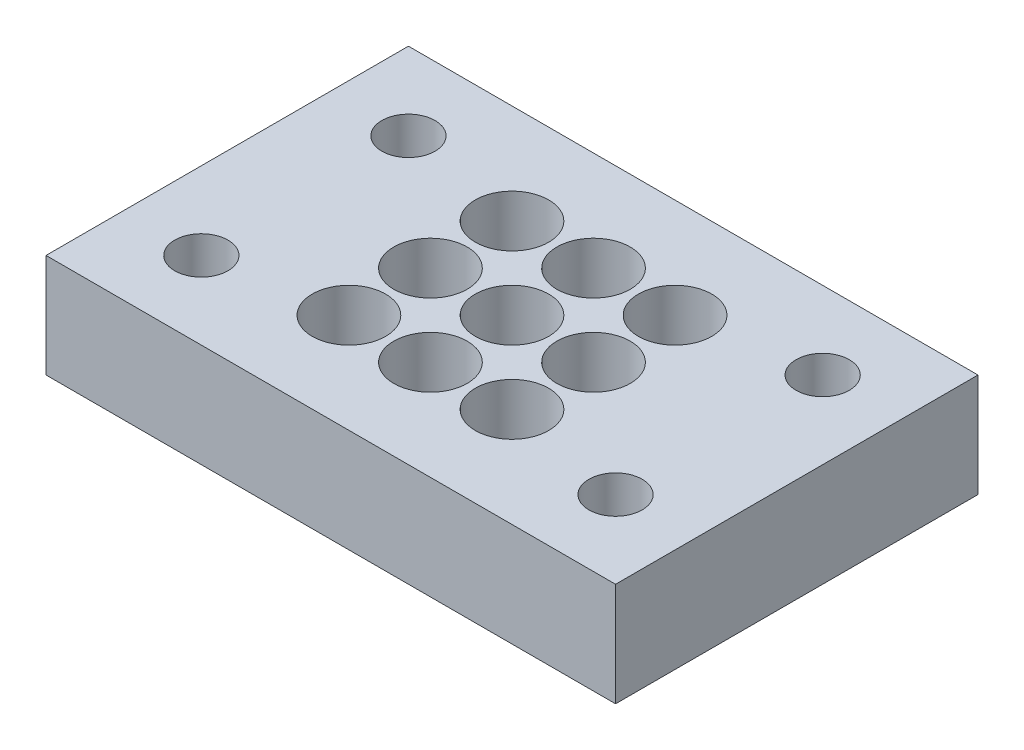
ISO-10303-21;
HEADER;
FILE_DESCRIPTION(('STEP AP214'),'2;1');
FILE_NAME('part.step','',(''),(''),'','','');
FILE_SCHEMA(('AUTOMOTIVE_DESIGN { 1 0 10303 214 1 1 1 1 }'));
ENDSEC;
DATA;
#1=APPLICATION_CONTEXT('core data for automotive mechanical design processes');
#2=APPLICATION_PROTOCOL_DEFINITION('international standard','automotive_design',2000,#1);
#3=PRODUCT_CONTEXT('',#1,'mechanical');
#4=PRODUCT('Part','Part','',(#3));
#5=PRODUCT_RELATED_PRODUCT_CATEGORY('part','',(#4));
#6=PRODUCT_DEFINITION_FORMATION('','',#4);
#7=PRODUCT_DEFINITION_CONTEXT('part definition',#1,'design');
#8=PRODUCT_DEFINITION('design','',#6,#7);
#9=PRODUCT_DEFINITION_SHAPE('','',#8);
#10=(LENGTH_UNIT() NAMED_UNIT(*) SI_UNIT(.MILLI.,.METRE.));
#11=(NAMED_UNIT(*) PLANE_ANGLE_UNIT() SI_UNIT($,.RADIAN.));
#12=(NAMED_UNIT(*) SI_UNIT($,.STERADIAN.) SOLID_ANGLE_UNIT());
#13=UNCERTAINTY_MEASURE_WITH_UNIT(LENGTH_MEASURE(1.E-05),#10,'distance_accuracy_value','');
#14=(GEOMETRIC_REPRESENTATION_CONTEXT(3) GLOBAL_UNCERTAINTY_ASSIGNED_CONTEXT((#13)) GLOBAL_UNIT_ASSIGNED_CONTEXT((#10,
#11,#12)) REPRESENTATION_CONTEXT('',''));
#15=CARTESIAN_POINT('',(0.,0.,0.));
#16=DIRECTION('',(0.,0.,1.));
#17=DIRECTION('',(1.,0.,0.));
#18=AXIS2_PLACEMENT_3D('',#15,#16,#17);
#19=CARTESIAN_POINT('',(0.,12.7,0.));
#20=DIRECTION('',(0.,0.,-1.));
#21=DIRECTION('',(-1.,0.,0.));
#22=AXIS2_PLACEMENT_3D('',#19,#20,#21);
#23=PLANE('',#22);
#24=DIRECTION('',(1.,0.,0.));
#25=VECTOR('',#24,1.);
#26=CARTESIAN_POINT('',(0.,0.,0.));
#27=LINE('',#26,#25);
#28=CARTESIAN_POINT('',(0.,0.,0.));
#29=VERTEX_POINT('',#28);
#30=CARTESIAN_POINT('',(69.85,0.,0.));
#31=VERTEX_POINT('',#30);
#32=EDGE_CURVE('E168',#29,#31,#27,.T.);
#33=ORIENTED_EDGE('',*,*,#32,.T.);
#34=DIRECTION('',(0.,-1.,0.));
#35=VECTOR('',#34,1.);
#36=CARTESIAN_POINT('',(69.85,12.7,0.));
#37=LINE('',#36,#35);
#38=CARTESIAN_POINT('',(69.85,12.7,0.));
#39=VERTEX_POINT('',#38);
#40=EDGE_CURVE('E11',#39,#31,#37,.T.);
#41=ORIENTED_EDGE('',*,*,#40,.F.);
#42=DIRECTION('',(1.,0.,0.));
#43=VECTOR('',#42,1.);
#44=CARTESIAN_POINT('',(0.,12.7,0.));
#45=LINE('',#44,#43);
#46=CARTESIAN_POINT('',(0.,12.7,0.));
#47=VERTEX_POINT('',#46);
#48=EDGE_CURVE('E98',#47,#39,#45,.T.);
#49=ORIENTED_EDGE('',*,*,#48,.F.);
#50=DIRECTION('',(0.,-1.,0.));
#51=VECTOR('',#50,1.);
#52=CARTESIAN_POINT('',(0.,12.7,0.));
#53=LINE('',#52,#51);
#54=EDGE_CURVE('E65',#47,#29,#53,.T.);
#55=ORIENTED_EDGE('',*,*,#54,.T.);
#56=EDGE_LOOP('',(#33,#41,#49,#55));
#57=FACE_BOUND('',#56,.T.);
#58=ADVANCED_FACE('F47',(#57),#23,.F.);
#59=CARTESIAN_POINT('',(69.85,12.7,0.));
#60=DIRECTION('',(-1.,0.,0.));
#61=DIRECTION('',(0.,0.,1.));
#62=AXIS2_PLACEMENT_3D('',#59,#60,#61);
#63=PLANE('',#62);
#64=DIRECTION('',(0.,0.,-1.));
#65=VECTOR('',#64,1.);
#66=CARTESIAN_POINT('',(69.85,0.,0.));
#67=LINE('',#66,#65);
#68=CARTESIAN_POINT('',(69.85,0.,-44.45));
#69=VERTEX_POINT('',#68);
#70=EDGE_CURVE('E104',#31,#69,#67,.T.);
#71=ORIENTED_EDGE('',*,*,#70,.T.);
#72=DIRECTION('',(0.,-1.,0.));
#73=VECTOR('',#72,1.);
#74=CARTESIAN_POINT('',(69.85,12.7,-44.45));
#75=LINE('',#74,#73);
#76=CARTESIAN_POINT('',(69.85,12.7,-44.45));
#77=VERTEX_POINT('',#76);
#78=EDGE_CURVE('E57',#77,#69,#75,.T.);
#79=ORIENTED_EDGE('',*,*,#78,.F.);
#80=DIRECTION('',(0.,0.,-1.));
#81=VECTOR('',#80,1.);
#82=CARTESIAN_POINT('',(69.85,12.7,0.));
#83=LINE('',#82,#81);
#84=EDGE_CURVE('E90',#39,#77,#83,.T.);
#85=ORIENTED_EDGE('',*,*,#84,.F.);
#86=ORIENTED_EDGE('',*,*,#40,.T.);
#87=EDGE_LOOP('',(#71,#79,#85,#86));
#88=FACE_BOUND('',#87,.T.);
#89=ADVANCED_FACE('F103',(#88),#63,.F.);
#90=CARTESIAN_POINT('',(0.,12.7,-44.45));
#91=DIRECTION('',(0.,0.,-1.));
#92=DIRECTION('',(-1.,0.,0.));
#93=AXIS2_PLACEMENT_3D('',#90,#91,#92);
#94=PLANE('',#93);
#95=DIRECTION('',(1.,0.,0.));
#96=VECTOR('',#95,1.);
#97=CARTESIAN_POINT('',(0.,0.,-44.45));
#98=LINE('',#97,#96);
#99=CARTESIAN_POINT('',(0.,0.,-44.45));
#100=VERTEX_POINT('',#99);
#101=EDGE_CURVE('E173',#100,#69,#98,.T.);
#102=ORIENTED_EDGE('',*,*,#101,.F.);
#103=DIRECTION('',(0.,-1.,0.));
#104=VECTOR('',#103,1.);
#105=CARTESIAN_POINT('',(0.,12.7,-44.45));
#106=LINE('',#105,#104);
#107=CARTESIAN_POINT('',(0.,12.7,-44.45));
#108=VERTEX_POINT('',#107);
#109=EDGE_CURVE('E79',#108,#100,#106,.T.);
#110=ORIENTED_EDGE('',*,*,#109,.F.);
#111=DIRECTION('',(1.,0.,0.));
#112=VECTOR('',#111,1.);
#113=CARTESIAN_POINT('',(0.,12.7,-44.45));
#114=LINE('',#113,#112);
#115=EDGE_CURVE('E97',#108,#77,#114,.T.);
#116=ORIENTED_EDGE('',*,*,#115,.T.);
#117=ORIENTED_EDGE('',*,*,#78,.T.);
#118=EDGE_LOOP('',(#102,#110,#116,#117));
#119=FACE_BOUND('',#118,.T.);
#120=ADVANCED_FACE('F108',(#119),#94,.T.);
#121=CARTESIAN_POINT('',(9.525,12.7,-34.925));
#122=DIRECTION('',(0.,-1.,0.));
#123=DIRECTION('',(0.,0.,-1.));
#124=AXIS2_PLACEMENT_3D('',#121,#122,#123);
#125=CYLINDRICAL_SURFACE('',#124,3.2639);
#126=CARTESIAN_POINT('',(9.525,12.7,-34.925));
#127=DIRECTION('',(0.,1.,0.));
#128=DIRECTION('',(0.,0.,1.));
#129=AXIS2_PLACEMENT_3D('',#126,#127,#128);
#130=CIRCLE('',#129,3.2639);
#131=CARTESIAN_POINT('',(9.525,12.7,-31.6611));
#132=VERTEX_POINT('',#131);
#133=EDGE_CURVE('E235',#132,#132,#130,.T.);
#134=ORIENTED_EDGE('',*,*,#133,.T.);
#135=EDGE_LOOP('',(#134));
#136=FACE_BOUND('',#135,.T.);
#137=CARTESIAN_POINT('',(9.525,0.,-34.925));
#138=DIRECTION('',(0.,1.,0.));
#139=DIRECTION('',(0.,0.,1.));
#140=AXIS2_PLACEMENT_3D('',#137,#138,#139);
#141=CIRCLE('',#140,3.2639);
#142=CARTESIAN_POINT('',(9.525,0.,-31.6611));
#143=VERTEX_POINT('',#142);
#144=EDGE_CURVE('E164',#143,#143,#141,.T.);
#145=ORIENTED_EDGE('',*,*,#144,.F.);
#146=EDGE_LOOP('',(#145));
#147=FACE_BOUND('',#146,.T.);
#148=ADVANCED_FACE('F241',(#136,#147),#125,.F.);
#149=CARTESIAN_POINT('',(60.325,12.7,-34.925));
#150=DIRECTION('',(0.,-1.,0.));
#151=DIRECTION('',(0.,0.,-1.));
#152=AXIS2_PLACEMENT_3D('',#149,#150,#151);
#153=CYLINDRICAL_SURFACE('',#152,3.2639);
#154=CARTESIAN_POINT('',(60.325,12.7,-34.925));
#155=DIRECTION('',(0.,1.,0.));
#156=DIRECTION('',(0.,0.,1.));
#157=AXIS2_PLACEMENT_3D('',#154,#155,#156);
#158=CIRCLE('',#157,3.2639);
#159=CARTESIAN_POINT('',(60.325,12.7,-31.6611));
#160=VERTEX_POINT('',#159);
#161=EDGE_CURVE('E231',#160,#160,#158,.T.);
#162=ORIENTED_EDGE('',*,*,#161,.T.);
#163=EDGE_LOOP('',(#162));
#164=FACE_BOUND('',#163,.T.);
#165=CARTESIAN_POINT('',(60.325,0.,-34.925));
#166=DIRECTION('',(0.,1.,0.));
#167=DIRECTION('',(0.,0.,1.));
#168=AXIS2_PLACEMENT_3D('',#165,#166,#167);
#169=CIRCLE('',#168,3.2639);
#170=CARTESIAN_POINT('',(60.325,0.,-31.6611));
#171=VERTEX_POINT('',#170);
#172=EDGE_CURVE('E160',#171,#171,#169,.T.);
#173=ORIENTED_EDGE('',*,*,#172,.F.);
#174=EDGE_LOOP('',(#173));
#175=FACE_BOUND('',#174,.T.);
#176=ADVANCED_FACE('F267',(#164,#175),#153,.F.);
#177=CARTESIAN_POINT('',(9.52500000000001,12.7,-9.525));
#178=DIRECTION('',(0.,-1.,0.));
#179=DIRECTION('',(0.,0.,-1.));
#180=AXIS2_PLACEMENT_3D('',#177,#178,#179);
#181=CYLINDRICAL_SURFACE('',#180,3.2639);
#182=CARTESIAN_POINT('',(9.52500000000001,12.7,-9.525));
#183=DIRECTION('',(0.,1.,0.));
#184=DIRECTION('',(0.,0.,1.));
#185=AXIS2_PLACEMENT_3D('',#182,#183,#184);
#186=CIRCLE('',#185,3.2639);
#187=CARTESIAN_POINT('',(9.52500000000001,12.7,-6.2611));
#188=VERTEX_POINT('',#187);
#189=EDGE_CURVE('E227',#188,#188,#186,.T.);
#190=ORIENTED_EDGE('',*,*,#189,.T.);
#191=EDGE_LOOP('',(#190));
#192=FACE_BOUND('',#191,.T.);
#193=CARTESIAN_POINT('',(9.52500000000001,0.,-9.525));
#194=DIRECTION('',(0.,1.,0.));
#195=DIRECTION('',(0.,0.,1.));
#196=AXIS2_PLACEMENT_3D('',#193,#194,#195);
#197=CIRCLE('',#196,3.2639);
#198=CARTESIAN_POINT('',(9.52500000000001,0.,-6.2611));
#199=VERTEX_POINT('',#198);
#200=EDGE_CURVE('E156',#199,#199,#197,.T.);
#201=ORIENTED_EDGE('',*,*,#200,.F.);
#202=EDGE_LOOP('',(#201));
#203=FACE_BOUND('',#202,.T.);
#204=ADVANCED_FACE('F270',(#192,#203),#181,.F.);
#205=CARTESIAN_POINT('',(60.325,12.7,-9.525));
#206=DIRECTION('',(0.,-1.,0.));
#207=DIRECTION('',(0.,0.,-1.));
#208=AXIS2_PLACEMENT_3D('',#205,#206,#207);
#209=CYLINDRICAL_SURFACE('',#208,3.26389999999999);
#210=CARTESIAN_POINT('',(60.325,12.7,-9.525));
#211=DIRECTION('',(0.,1.,0.));
#212=DIRECTION('',(0.,0.,1.));
#213=AXIS2_PLACEMENT_3D('',#210,#211,#212);
#214=CIRCLE('',#213,3.26389999999999);
#215=CARTESIAN_POINT('',(60.325,12.7,-6.2611));
#216=VERTEX_POINT('',#215);
#217=EDGE_CURVE('E223',#216,#216,#214,.T.);
#218=ORIENTED_EDGE('',*,*,#217,.T.);
#219=EDGE_LOOP('',(#218));
#220=FACE_BOUND('',#219,.T.);
#221=CARTESIAN_POINT('',(60.325,0.,-9.525));
#222=DIRECTION('',(0.,1.,0.));
#223=DIRECTION('',(0.,0.,1.));
#224=AXIS2_PLACEMENT_3D('',#221,#222,#223);
#225=CIRCLE('',#224,3.26389999999999);
#226=CARTESIAN_POINT('',(60.325,0.,-6.2611));
#227=VERTEX_POINT('',#226);
#228=EDGE_CURVE('E152',#227,#227,#225,.T.);
#229=ORIENTED_EDGE('',*,*,#228,.F.);
#230=EDGE_LOOP('',(#229));
#231=FACE_BOUND('',#230,.T.);
#232=ADVANCED_FACE('F274',(#220,#231),#209,.F.);
#233=CARTESIAN_POINT('',(34.925,12.7,-22.225));
#234=DIRECTION('',(0.,-1.,0.));
#235=DIRECTION('',(0.,0.,-1.));
#236=AXIS2_PLACEMENT_3D('',#233,#234,#235);
#237=CYLINDRICAL_SURFACE('',#236,4.5);
#238=CARTESIAN_POINT('',(34.925,12.7,-22.225));
#239=DIRECTION('',(0.,1.,0.));
#240=DIRECTION('',(0.,0.,1.));
#241=AXIS2_PLACEMENT_3D('',#238,#239,#240);
#242=CIRCLE('',#241,4.5);
#243=CARTESIAN_POINT('',(34.925,12.7,-17.725));
#244=VERTEX_POINT('',#243);
#245=EDGE_CURVE('E219',#244,#244,#242,.T.);
#246=ORIENTED_EDGE('',*,*,#245,.T.);
#247=EDGE_LOOP('',(#246));
#248=FACE_BOUND('',#247,.T.);
#249=CARTESIAN_POINT('',(34.925,0.,-22.225));
#250=DIRECTION('',(0.,1.,0.));
#251=DIRECTION('',(0.,0.,1.));
#252=AXIS2_PLACEMENT_3D('',#249,#250,#251);
#253=CIRCLE('',#252,4.5);
#254=CARTESIAN_POINT('',(34.925,0.,-17.725));
#255=VERTEX_POINT('',#254);
#256=EDGE_CURVE('E148',#255,#255,#253,.T.);
#257=ORIENTED_EDGE('',*,*,#256,.F.);
#258=EDGE_LOOP('',(#257));
#259=FACE_BOUND('',#258,.T.);
#260=ADVANCED_FACE('F278',(#248,#259),#237,.F.);
#261=CARTESIAN_POINT('',(44.925,12.7,-22.225));
#262=DIRECTION('',(0.,-1.,0.));
#263=DIRECTION('',(0.,0.,-1.));
#264=AXIS2_PLACEMENT_3D('',#261,#262,#263);
#265=CYLINDRICAL_SURFACE('',#264,4.5);
#266=CARTESIAN_POINT('',(44.925,12.7,-22.225));
#267=DIRECTION('',(0.,1.,0.));
#268=DIRECTION('',(0.,0.,1.));
#269=AXIS2_PLACEMENT_3D('',#266,#267,#268);
#270=CIRCLE('',#269,4.5);
#271=CARTESIAN_POINT('',(44.925,12.7,-17.725));
#272=VERTEX_POINT('',#271);
#273=EDGE_CURVE('E215',#272,#272,#270,.T.);
#274=ORIENTED_EDGE('',*,*,#273,.T.);
#275=EDGE_LOOP('',(#274));
#276=FACE_BOUND('',#275,.T.);
#277=CARTESIAN_POINT('',(44.925,0.,-22.225));
#278=DIRECTION('',(0.,1.,0.));
#279=DIRECTION('',(0.,0.,1.));
#280=AXIS2_PLACEMENT_3D('',#277,#278,#279);
#281=CIRCLE('',#280,4.5);
#282=CARTESIAN_POINT('',(44.925,0.,-17.725));
#283=VERTEX_POINT('',#282);
#284=EDGE_CURVE('E144',#283,#283,#281,.T.);
#285=ORIENTED_EDGE('',*,*,#284,.F.);
#286=EDGE_LOOP('',(#285));
#287=FACE_BOUND('',#286,.T.);
#288=ADVANCED_FACE('F282',(#276,#287),#265,.F.);
#289=CARTESIAN_POINT('',(44.925,12.7,-32.225));
#290=DIRECTION('',(0.,-1.,0.));
#291=DIRECTION('',(0.,0.,-1.));
#292=AXIS2_PLACEMENT_3D('',#289,#290,#291);
#293=CYLINDRICAL_SURFACE('',#292,4.5);
#294=CARTESIAN_POINT('',(44.925,12.7,-32.225));
#295=DIRECTION('',(0.,1.,0.));
#296=DIRECTION('',(0.,0.,1.));
#297=AXIS2_PLACEMENT_3D('',#294,#295,#296);
#298=CIRCLE('',#297,4.5);
#299=CARTESIAN_POINT('',(44.925,12.7,-27.725));
#300=VERTEX_POINT('',#299);
#301=EDGE_CURVE('E211',#300,#300,#298,.T.);
#302=ORIENTED_EDGE('',*,*,#301,.T.);
#303=EDGE_LOOP('',(#302));
#304=FACE_BOUND('',#303,.T.);
#305=CARTESIAN_POINT('',(44.925,0.,-32.225));
#306=DIRECTION('',(0.,1.,0.));
#307=DIRECTION('',(0.,0.,1.));
#308=AXIS2_PLACEMENT_3D('',#305,#306,#307);
#309=CIRCLE('',#308,4.5);
#310=CARTESIAN_POINT('',(44.925,0.,-27.725));
#311=VERTEX_POINT('',#310);
#312=EDGE_CURVE('E140',#311,#311,#309,.T.);
#313=ORIENTED_EDGE('',*,*,#312,.F.);
#314=EDGE_LOOP('',(#313));
#315=FACE_BOUND('',#314,.T.);
#316=ADVANCED_FACE('F286',(#304,#315),#293,.F.);
#317=CARTESIAN_POINT('',(34.925,12.7,-32.225));
#318=DIRECTION('',(0.,-1.,0.));
#319=DIRECTION('',(0.,0.,-1.));
#320=AXIS2_PLACEMENT_3D('',#317,#318,#319);
#321=CYLINDRICAL_SURFACE('',#320,4.5);
#322=CARTESIAN_POINT('',(34.925,12.7,-32.225));
#323=DIRECTION('',(0.,1.,0.));
#324=DIRECTION('',(0.,0.,1.));
#325=AXIS2_PLACEMENT_3D('',#322,#323,#324);
#326=CIRCLE('',#325,4.5);
#327=CARTESIAN_POINT('',(34.925,12.7,-27.725));
#328=VERTEX_POINT('',#327);
#329=EDGE_CURVE('E207',#328,#328,#326,.T.);
#330=ORIENTED_EDGE('',*,*,#329,.T.);
#331=EDGE_LOOP('',(#330));
#332=FACE_BOUND('',#331,.T.);
#333=CARTESIAN_POINT('',(34.925,0.,-32.225));
#334=DIRECTION('',(0.,1.,0.));
#335=DIRECTION('',(0.,0.,1.));
#336=AXIS2_PLACEMENT_3D('',#333,#334,#335);
#337=CIRCLE('',#336,4.5);
#338=CARTESIAN_POINT('',(34.925,0.,-27.725));
#339=VERTEX_POINT('',#338);
#340=EDGE_CURVE('E136',#339,#339,#337,.T.);
#341=ORIENTED_EDGE('',*,*,#340,.F.);
#342=EDGE_LOOP('',(#341));
#343=FACE_BOUND('',#342,.T.);
#344=ADVANCED_FACE('F290',(#332,#343),#321,.F.);
#345=CARTESIAN_POINT('',(24.925,12.7,-22.2249999999999));
#346=DIRECTION('',(0.,-1.,0.));
#347=DIRECTION('',(0.,0.,-1.));
#348=AXIS2_PLACEMENT_3D('',#345,#346,#347);
#349=CYLINDRICAL_SURFACE('',#348,4.5);
#350=CARTESIAN_POINT('',(24.925,12.7,-22.2249999999999));
#351=DIRECTION('',(0.,1.,0.));
#352=DIRECTION('',(0.,0.,1.));
#353=AXIS2_PLACEMENT_3D('',#350,#351,#352);
#354=CIRCLE('',#353,4.5);
#355=CARTESIAN_POINT('',(24.925,12.7,-17.7249999999999));
#356=VERTEX_POINT('',#355);
#357=EDGE_CURVE('E203',#356,#356,#354,.T.);
#358=ORIENTED_EDGE('',*,*,#357,.T.);
#359=EDGE_LOOP('',(#358));
#360=FACE_BOUND('',#359,.T.);
#361=CARTESIAN_POINT('',(24.925,0.,-22.2249999999999));
#362=DIRECTION('',(0.,1.,0.));
#363=DIRECTION('',(0.,0.,1.));
#364=AXIS2_PLACEMENT_3D('',#361,#362,#363);
#365=CIRCLE('',#364,4.5);
#366=CARTESIAN_POINT('',(24.925,0.,-17.7249999999999));
#367=VERTEX_POINT('',#366);
#368=EDGE_CURVE('E132',#367,#367,#365,.T.);
#369=ORIENTED_EDGE('',*,*,#368,.F.);
#370=EDGE_LOOP('',(#369));
#371=FACE_BOUND('',#370,.T.);
#372=ADVANCED_FACE('F294',(#360,#371),#349,.F.);
#373=CARTESIAN_POINT('',(24.925,12.7,-32.2249999999999));
#374=DIRECTION('',(0.,-1.,0.));
#375=DIRECTION('',(0.,0.,-1.));
#376=AXIS2_PLACEMENT_3D('',#373,#374,#375);
#377=CYLINDRICAL_SURFACE('',#376,4.5);
#378=CARTESIAN_POINT('',(24.925,12.7,-32.2249999999999));
#379=DIRECTION('',(0.,1.,0.));
#380=DIRECTION('',(0.,0.,1.));
#381=AXIS2_PLACEMENT_3D('',#378,#379,#380);
#382=CIRCLE('',#381,4.5);
#383=CARTESIAN_POINT('',(24.925,12.7,-27.7249999999999));
#384=VERTEX_POINT('',#383);
#385=EDGE_CURVE('E199',#384,#384,#382,.T.);
#386=ORIENTED_EDGE('',*,*,#385,.T.);
#387=EDGE_LOOP('',(#386));
#388=FACE_BOUND('',#387,.T.);
#389=CARTESIAN_POINT('',(24.925,0.,-32.2249999999999));
#390=DIRECTION('',(0.,1.,0.));
#391=DIRECTION('',(0.,0.,1.));
#392=AXIS2_PLACEMENT_3D('',#389,#390,#391);
#393=CIRCLE('',#392,4.5);
#394=CARTESIAN_POINT('',(24.925,0.,-27.7249999999999));
#395=VERTEX_POINT('',#394);
#396=EDGE_CURVE('E128',#395,#395,#393,.T.);
#397=ORIENTED_EDGE('',*,*,#396,.F.);
#398=EDGE_LOOP('',(#397));
#399=FACE_BOUND('',#398,.T.);
#400=ADVANCED_FACE('F298',(#388,#399),#377,.F.);
#401=CARTESIAN_POINT('',(44.9250000000001,12.7,-12.225));
#402=DIRECTION('',(0.,-1.,0.));
#403=DIRECTION('',(0.,0.,-1.));
#404=AXIS2_PLACEMENT_3D('',#401,#402,#403);
#405=CYLINDRICAL_SURFACE('',#404,4.5);
#406=CARTESIAN_POINT('',(44.9250000000001,12.7,-12.225));
#407=DIRECTION('',(0.,1.,0.));
#408=DIRECTION('',(0.,0.,1.));
#409=AXIS2_PLACEMENT_3D('',#406,#407,#408);
#410=CIRCLE('',#409,4.5);
#411=CARTESIAN_POINT('',(44.9250000000001,12.7,-7.725));
#412=VERTEX_POINT('',#411);
#413=EDGE_CURVE('E193',#412,#412,#410,.T.);
#414=ORIENTED_EDGE('',*,*,#413,.T.);
#415=EDGE_LOOP('',(#414));
#416=FACE_BOUND('',#415,.T.);
#417=CARTESIAN_POINT('',(44.9250000000001,0.,-12.225));
#418=DIRECTION('',(0.,1.,0.));
#419=DIRECTION('',(0.,0.,1.));
#420=AXIS2_PLACEMENT_3D('',#417,#418,#419);
#421=CIRCLE('',#420,4.5);
#422=CARTESIAN_POINT('',(44.9250000000001,0.,-7.725));
#423=VERTEX_POINT('',#422);
#424=EDGE_CURVE('E124',#423,#423,#421,.T.);
#425=ORIENTED_EDGE('',*,*,#424,.F.);
#426=EDGE_LOOP('',(#425));
#427=FACE_BOUND('',#426,.T.);
#428=ADVANCED_FACE('F302',(#416,#427),#405,.F.);
#429=CARTESIAN_POINT('',(34.9250000000001,12.7,-12.225));
#430=DIRECTION('',(0.,-1.,0.));
#431=DIRECTION('',(0.,0.,-1.));
#432=AXIS2_PLACEMENT_3D('',#429,#430,#431);
#433=CYLINDRICAL_SURFACE('',#432,4.5);
#434=CARTESIAN_POINT('',(34.9250000000001,12.7,-12.225));
#435=DIRECTION('',(0.,1.,0.));
#436=DIRECTION('',(0.,0.,1.));
#437=AXIS2_PLACEMENT_3D('',#434,#435,#436);
#438=CIRCLE('',#437,4.5);
#439=CARTESIAN_POINT('',(34.9250000000001,12.7,-7.725));
#440=VERTEX_POINT('',#439);
#441=EDGE_CURVE('E187',#440,#440,#438,.T.);
#442=ORIENTED_EDGE('',*,*,#441,.T.);
#443=EDGE_LOOP('',(#442));
#444=FACE_BOUND('',#443,.T.);
#445=CARTESIAN_POINT('',(34.9250000000001,0.,-12.225));
#446=DIRECTION('',(0.,1.,0.));
#447=DIRECTION('',(0.,0.,1.));
#448=AXIS2_PLACEMENT_3D('',#445,#446,#447);
#449=CIRCLE('',#448,4.5);
#450=CARTESIAN_POINT('',(34.9250000000001,0.,-7.725));
#451=VERTEX_POINT('',#450);
#452=EDGE_CURVE('E120',#451,#451,#449,.T.);
#453=ORIENTED_EDGE('',*,*,#452,.F.);
#454=EDGE_LOOP('',(#453));
#455=FACE_BOUND('',#454,.T.);
#456=ADVANCED_FACE('F305',(#444,#455),#433,.F.);
#457=CARTESIAN_POINT('',(24.9250000000001,12.7,-12.225));
#458=DIRECTION('',(0.,-1.,0.));
#459=DIRECTION('',(0.,0.,-1.));
#460=AXIS2_PLACEMENT_3D('',#457,#458,#459);
#461=CYLINDRICAL_SURFACE('',#460,4.5);
#462=CARTESIAN_POINT('',(24.9250000000001,12.7,-12.225));
#463=DIRECTION('',(0.,1.,0.));
#464=DIRECTION('',(0.,0.,1.));
#465=AXIS2_PLACEMENT_3D('',#462,#463,#464);
#466=CIRCLE('',#465,4.5);
#467=CARTESIAN_POINT('',(24.9250000000001,12.7,-7.72499999999998));
#468=VERTEX_POINT('',#467);
#469=EDGE_CURVE('E180',#468,#468,#466,.T.);
#470=ORIENTED_EDGE('',*,*,#469,.T.);
#471=EDGE_LOOP('',(#470));
#472=FACE_BOUND('',#471,.T.);
#473=CARTESIAN_POINT('',(24.9250000000001,0.,-12.225));
#474=DIRECTION('',(0.,1.,0.));
#475=DIRECTION('',(0.,0.,1.));
#476=AXIS2_PLACEMENT_3D('',#473,#474,#475);
#477=CIRCLE('',#476,4.5);
#478=CARTESIAN_POINT('',(24.9250000000001,0.,-7.72499999999998));
#479=VERTEX_POINT('',#478);
#480=EDGE_CURVE('E116',#479,#479,#477,.T.);
#481=ORIENTED_EDGE('',*,*,#480,.F.);
#482=EDGE_LOOP('',(#481));
#483=FACE_BOUND('',#482,.T.);
#484=ADVANCED_FACE('F49',(#472,#483),#461,.F.);
#485=CARTESIAN_POINT('',(0.,12.7,0.));
#486=DIRECTION('',(-1.,0.,0.));
#487=DIRECTION('',(0.,0.,1.));
#488=AXIS2_PLACEMENT_3D('',#485,#486,#487);
#489=PLANE('',#488);
#490=DIRECTION('',(0.,0.,-1.));
#491=VECTOR('',#490,1.);
#492=CARTESIAN_POINT('',(0.,0.,0.));
#493=LINE('',#492,#491);
#494=EDGE_CURVE('E176',#29,#100,#493,.T.);
#495=ORIENTED_EDGE('',*,*,#494,.F.);
#496=ORIENTED_EDGE('',*,*,#54,.F.);
#497=DIRECTION('',(0.,0.,-1.));
#498=VECTOR('',#497,1.);
#499=CARTESIAN_POINT('',(0.,12.7,0.));
#500=LINE('',#499,#498);
#501=EDGE_CURVE('E110',#47,#108,#500,.T.);
#502=ORIENTED_EDGE('',*,*,#501,.T.);
#503=ORIENTED_EDGE('',*,*,#109,.T.);
#504=EDGE_LOOP('',(#495,#496,#502,#503));
#505=FACE_BOUND('',#504,.T.);
#506=ADVANCED_FACE('F246',(#505),#489,.T.);
#507=CARTESIAN_POINT('',(0.,12.7,0.));
#508=DIRECTION('',(0.,1.,0.));
#509=DIRECTION('',(0.,0.,1.));
#510=AXIS2_PLACEMENT_3D('',#507,#508,#509);
#511=PLANE('',#510);
#512=ORIENTED_EDGE('',*,*,#469,.F.);
#513=EDGE_LOOP('',(#512));
#514=FACE_BOUND('',#513,.T.);
#515=ORIENTED_EDGE('',*,*,#441,.F.);
#516=EDGE_LOOP('',(#515));
#517=FACE_BOUND('',#516,.T.);
#518=ORIENTED_EDGE('',*,*,#413,.F.);
#519=EDGE_LOOP('',(#518));
#520=FACE_BOUND('',#519,.T.);
#521=ORIENTED_EDGE('',*,*,#385,.F.);
#522=EDGE_LOOP('',(#521));
#523=FACE_BOUND('',#522,.T.);
#524=ORIENTED_EDGE('',*,*,#357,.F.);
#525=EDGE_LOOP('',(#524));
#526=FACE_BOUND('',#525,.T.);
#527=ORIENTED_EDGE('',*,*,#329,.F.);
#528=EDGE_LOOP('',(#527));
#529=FACE_BOUND('',#528,.T.);
#530=ORIENTED_EDGE('',*,*,#301,.F.);
#531=EDGE_LOOP('',(#530));
#532=FACE_BOUND('',#531,.T.);
#533=ORIENTED_EDGE('',*,*,#273,.F.);
#534=EDGE_LOOP('',(#533));
#535=FACE_BOUND('',#534,.T.);
#536=ORIENTED_EDGE('',*,*,#245,.F.);
#537=EDGE_LOOP('',(#536));
#538=FACE_BOUND('',#537,.T.);
#539=ORIENTED_EDGE('',*,*,#217,.F.);
#540=EDGE_LOOP('',(#539));
#541=FACE_BOUND('',#540,.T.);
#542=ORIENTED_EDGE('',*,*,#189,.F.);
#543=EDGE_LOOP('',(#542));
#544=FACE_BOUND('',#543,.T.);
#545=ORIENTED_EDGE('',*,*,#161,.F.);
#546=EDGE_LOOP('',(#545));
#547=FACE_BOUND('',#546,.T.);
#548=ORIENTED_EDGE('',*,*,#133,.F.);
#549=EDGE_LOOP('',(#548));
#550=FACE_BOUND('',#549,.T.);
#551=ORIENTED_EDGE('',*,*,#48,.T.);
#552=ORIENTED_EDGE('',*,*,#84,.T.);
#553=ORIENTED_EDGE('',*,*,#115,.F.);
#554=ORIENTED_EDGE('',*,*,#501,.F.);
#555=EDGE_LOOP('',(#551,#552,#553,#554));
#556=FACE_BOUND('',#555,.T.);
#557=ADVANCED_FACE('F94',(#514,#517,#520,#523,#526,#529,#532,#535,#538,#541,#544,#547,#550,
#556),#511,.T.);
#558=CARTESIAN_POINT('',(0.,0.,0.));
#559=DIRECTION('',(0.,1.,0.));
#560=DIRECTION('',(0.,0.,1.));
#561=AXIS2_PLACEMENT_3D('',#558,#559,#560);
#562=PLANE('',#561);
#563=ORIENTED_EDGE('',*,*,#480,.T.);
#564=EDGE_LOOP('',(#563));
#565=FACE_BOUND('',#564,.T.);
#566=ORIENTED_EDGE('',*,*,#452,.T.);
#567=EDGE_LOOP('',(#566));
#568=FACE_BOUND('',#567,.T.);
#569=ORIENTED_EDGE('',*,*,#424,.T.);
#570=EDGE_LOOP('',(#569));
#571=FACE_BOUND('',#570,.T.);
#572=ORIENTED_EDGE('',*,*,#396,.T.);
#573=EDGE_LOOP('',(#572));
#574=FACE_BOUND('',#573,.T.);
#575=ORIENTED_EDGE('',*,*,#368,.T.);
#576=EDGE_LOOP('',(#575));
#577=FACE_BOUND('',#576,.T.);
#578=ORIENTED_EDGE('',*,*,#340,.T.);
#579=EDGE_LOOP('',(#578));
#580=FACE_BOUND('',#579,.T.);
#581=ORIENTED_EDGE('',*,*,#312,.T.);
#582=EDGE_LOOP('',(#581));
#583=FACE_BOUND('',#582,.T.);
#584=ORIENTED_EDGE('',*,*,#284,.T.);
#585=EDGE_LOOP('',(#584));
#586=FACE_BOUND('',#585,.T.);
#587=ORIENTED_EDGE('',*,*,#256,.T.);
#588=EDGE_LOOP('',(#587));
#589=FACE_BOUND('',#588,.T.);
#590=ORIENTED_EDGE('',*,*,#228,.T.);
#591=EDGE_LOOP('',(#590));
#592=FACE_BOUND('',#591,.T.);
#593=ORIENTED_EDGE('',*,*,#200,.T.);
#594=EDGE_LOOP('',(#593));
#595=FACE_BOUND('',#594,.T.);
#596=ORIENTED_EDGE('',*,*,#172,.T.);
#597=EDGE_LOOP('',(#596));
#598=FACE_BOUND('',#597,.T.);
#599=ORIENTED_EDGE('',*,*,#144,.T.);
#600=EDGE_LOOP('',(#599));
#601=FACE_BOUND('',#600,.T.);
#602=ORIENTED_EDGE('',*,*,#32,.F.);
#603=ORIENTED_EDGE('',*,*,#494,.T.);
#604=ORIENTED_EDGE('',*,*,#101,.T.);
#605=ORIENTED_EDGE('',*,*,#70,.F.);
#606=EDGE_LOOP('',(#602,#603,#604,#605));
#607=FACE_BOUND('',#606,.T.);
#608=ADVANCED_FACE('F245',(#565,#568,#571,#574,#577,#580,#583,#586,#589,#592,#595,#598,#601,
#607),#562,.F.);
#609=CLOSED_SHELL('',(#58,#89,#120,#148,#176,#204,#232,#260,#288,#316,#344,#372,#400,#428,#456,
#484,#506,#557,#608));
#610=MANIFOLD_SOLID_BREP('B2',#609);
#611=ADVANCED_BREP_SHAPE_REPRESENTATION('',(#18,#610),#14);
#612=SHAPE_DEFINITION_REPRESENTATION(#9,#611);
ENDSEC;
END-ISO-10303-21;
